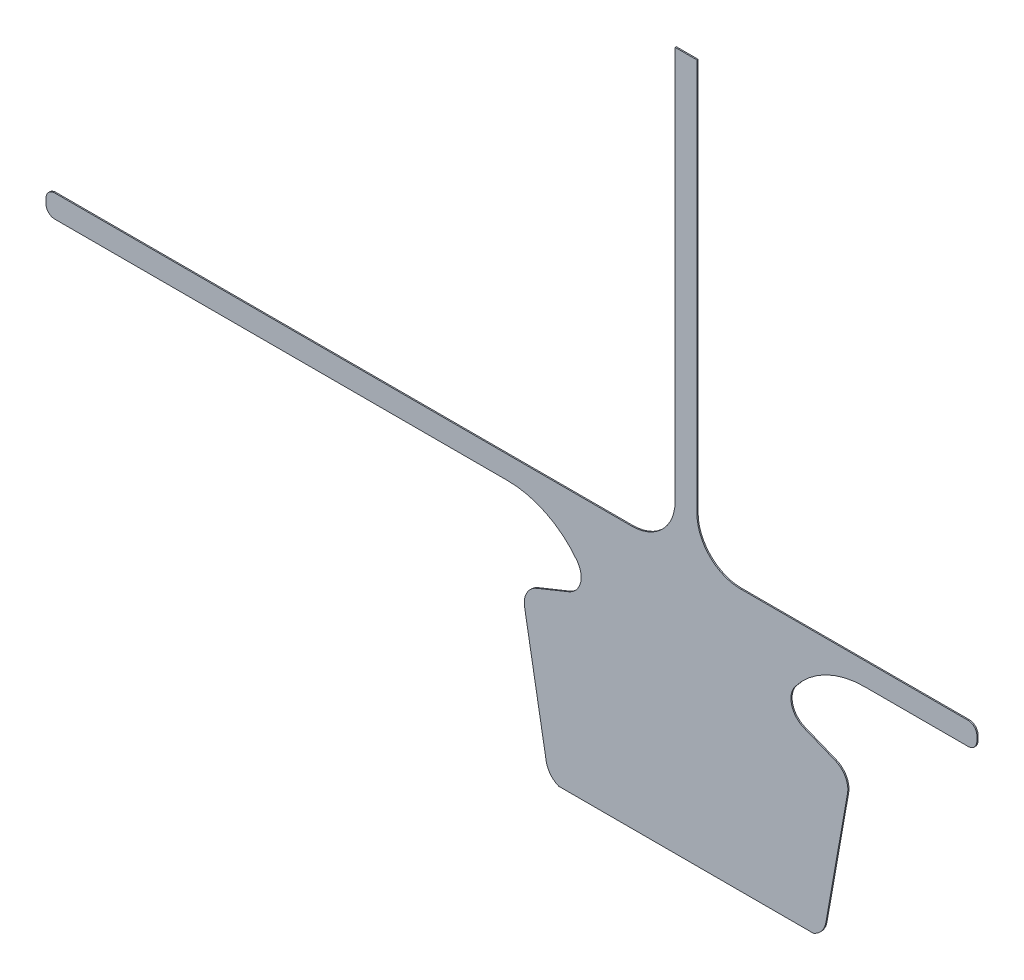
ISO-10303-21;
HEADER;
FILE_DESCRIPTION(('STEP AP214'),'2;1');
FILE_NAME('part.step','',(''),(''),'','','');
FILE_SCHEMA(('AUTOMOTIVE_DESIGN { 1 0 10303 214 1 1 1 1 }'));
ENDSEC;
DATA;
#1=APPLICATION_CONTEXT('core data for automotive mechanical design processes');
#2=APPLICATION_PROTOCOL_DEFINITION('international standard','automotive_design',2000,#1);
#3=PRODUCT_CONTEXT('',#1,'mechanical');
#4=PRODUCT('Part','Part','',(#3));
#5=PRODUCT_RELATED_PRODUCT_CATEGORY('part','',(#4));
#6=PRODUCT_DEFINITION_FORMATION('','',#4);
#7=PRODUCT_DEFINITION_CONTEXT('part definition',#1,'design');
#8=PRODUCT_DEFINITION('design','',#6,#7);
#9=PRODUCT_DEFINITION_SHAPE('','',#8);
#10=(LENGTH_UNIT() NAMED_UNIT(*) SI_UNIT(.MILLI.,.METRE.));
#11=(NAMED_UNIT(*) PLANE_ANGLE_UNIT() SI_UNIT($,.RADIAN.));
#12=(NAMED_UNIT(*) SI_UNIT($,.STERADIAN.) SOLID_ANGLE_UNIT());
#13=UNCERTAINTY_MEASURE_WITH_UNIT(LENGTH_MEASURE(1.E-05),#10,'distance_accuracy_value','');
#14=(GEOMETRIC_REPRESENTATION_CONTEXT(3) GLOBAL_UNCERTAINTY_ASSIGNED_CONTEXT((#13)) GLOBAL_UNIT_ASSIGNED_CONTEXT((#10,
#11,#12)) REPRESENTATION_CONTEXT('',''));
#15=CARTESIAN_POINT('',(0.,0.,0.));
#16=DIRECTION('',(0.,0.,1.));
#17=DIRECTION('',(1.,0.,0.));
#18=AXIS2_PLACEMENT_3D('',#15,#16,#17);
#19=CARTESIAN_POINT('',(-109.35102561515,167.803727772906,1.016));
#20=DIRECTION('',(0.,0.,-1.));
#21=DIRECTION('',(-1.,0.,0.));
#22=AXIS2_PLACEMENT_3D('',#19,#20,#21);
#23=CYLINDRICAL_SURFACE('',#22,17.7800000000008);
#24=CARTESIAN_POINT('',(-109.35102561515,167.803727772906,0.));
#25=DIRECTION('',(0.,0.,-1.));
#26=DIRECTION('',(1.,0.,0.));
#27=AXIS2_PLACEMENT_3D('',#24,#25,#26);
#28=CIRCLE('',#27,17.7800000000008);
#29=CARTESIAN_POINT('',(-95.1549494052422,178.508858329915,0.));
#30=VERTEX_POINT('',#29);
#31=CARTESIAN_POINT('',(-102.690520384216,151.318398838708,0.));
#32=VERTEX_POINT('',#31);
#33=EDGE_CURVE('E250',#30,#32,#28,.T.);
#34=ORIENTED_EDGE('',*,*,#33,.T.);
#35=DIRECTION('',(0.,0.,-1.));
#36=VECTOR('',#35,1.);
#37=CARTESIAN_POINT('',(-102.690520384216,151.318398838708,1.016));
#38=LINE('',#37,#36);
#39=CARTESIAN_POINT('',(-102.690520384216,151.318398838708,1.016));
#40=VERTEX_POINT('',#39);
#41=EDGE_CURVE('E11',#40,#32,#38,.T.);
#42=ORIENTED_EDGE('',*,*,#41,.F.);
#43=CARTESIAN_POINT('',(-109.35102561515,167.803727772906,1.016));
#44=DIRECTION('',(0.,0.,-1.));
#45=DIRECTION('',(1.,0.,0.));
#46=AXIS2_PLACEMENT_3D('',#43,#44,#45);
#47=CIRCLE('',#46,17.7800000000008);
#48=CARTESIAN_POINT('',(-95.1549494052422,178.508858329915,1.016));
#49=VERTEX_POINT('',#48);
#50=EDGE_CURVE('E304',#49,#40,#47,.T.);
#51=ORIENTED_EDGE('',*,*,#50,.F.);
#52=DIRECTION('',(0.,0.,-1.));
#53=VECTOR('',#52,1.);
#54=CARTESIAN_POINT('',(-95.1549494052422,178.508858329915,1.016));
#55=LINE('',#54,#53);
#56=EDGE_CURVE('E246',#49,#30,#55,.T.);
#57=ORIENTED_EDGE('',*,*,#56,.T.);
#58=EDGE_LOOP('',(#34,#42,#51,#57));
#59=FACE_BOUND('',#58,.T.);
#60=ADVANCED_FACE('F34',(#59),#23,.F.);
#61=CARTESIAN_POINT('',(-102.690520384216,151.318398838708,1.016));
#62=DIRECTION('',(0.374606593416,-0.927183854566752,0.));
#63=DIRECTION('',(0.927183854566752,0.374606593416,0.));
#64=AXIS2_PLACEMENT_3D('',#61,#62,#63);
#65=PLANE('',#64);
#66=DIRECTION('',(-0.927183854566752,-0.374606593416,0.));
#67=VECTOR('',#66,1.);
#68=CARTESIAN_POINT('',(-102.690520384216,151.318398838708,0.));
#69=LINE('',#68,#67);
#70=CARTESIAN_POINT('',(-130.138661402998,140.228630016695,0.));
#71=VERTEX_POINT('',#70);
#72=EDGE_CURVE('E253',#32,#71,#69,.T.);
#73=ORIENTED_EDGE('',*,*,#72,.T.);
#74=DIRECTION('',(0.,0.,-1.));
#75=VECTOR('',#74,1.);
#76=CARTESIAN_POINT('',(-130.138661402998,140.228630016695,1.016));
#77=LINE('',#76,#75);
#78=CARTESIAN_POINT('',(-130.138661402998,140.228630016695,1.016));
#79=VERTEX_POINT('',#78);
#80=EDGE_CURVE('E42',#79,#71,#77,.T.);
#81=ORIENTED_EDGE('',*,*,#80,.F.);
#82=DIRECTION('',(-0.927183854566752,-0.374606593416,0.));
#83=VECTOR('',#82,1.);
#84=CARTESIAN_POINT('',(-102.690520384216,151.318398838708,1.016));
#85=LINE('',#84,#83);
#86=EDGE_CURVE('E153',#40,#79,#85,.T.);
#87=ORIENTED_EDGE('',*,*,#86,.F.);
#88=ORIENTED_EDGE('',*,*,#41,.T.);
#89=EDGE_LOOP('',(#73,#81,#87,#88));
#90=FACE_BOUND('',#89,.T.);
#91=ADVANCED_FACE('F462',(#90),#65,.F.);
#92=CARTESIAN_POINT('',(-123.478156172063,123.743301082497,1.016));
#93=DIRECTION('',(0.,0.,-1.));
#94=DIRECTION('',(-1.,0.,0.));
#95=AXIS2_PLACEMENT_3D('',#92,#93,#94);
#96=CYLINDRICAL_SURFACE('',#95,17.7800000000006);
#97=CARTESIAN_POINT('',(-123.478156172063,123.743301082497,0.));
#98=DIRECTION('',(0.,0.,1.));
#99=DIRECTION('',(1.,0.,0.));
#100=AXIS2_PLACEMENT_3D('',#97,#98,#99);
#101=CIRCLE('',#100,17.7800000000006);
#102=CARTESIAN_POINT('',(-140.98803802062,120.655836483576,0.));
#103=VERTEX_POINT('',#102);
#104=EDGE_CURVE('E255',#71,#103,#101,.T.);
#105=ORIENTED_EDGE('',*,*,#104,.T.);
#106=DIRECTION('',(0.,0.,-1.));
#107=VECTOR('',#106,1.);
#108=CARTESIAN_POINT('',(-140.98803802062,120.655836483576,1.016));
#109=LINE('',#108,#107);
#110=CARTESIAN_POINT('',(-140.98803802062,120.655836483576,1.016));
#111=VERTEX_POINT('',#110);
#112=EDGE_CURVE('E371',#111,#103,#109,.T.);
#113=ORIENTED_EDGE('',*,*,#112,.F.);
#114=CARTESIAN_POINT('',(-123.478156172063,123.743301082497,1.016));
#115=DIRECTION('',(0.,0.,1.));
#116=DIRECTION('',(1.,0.,0.));
#117=AXIS2_PLACEMENT_3D('',#114,#115,#116);
#118=CIRCLE('',#117,17.7800000000006);
#119=EDGE_CURVE('E379',#79,#111,#118,.T.);
#120=ORIENTED_EDGE('',*,*,#119,.F.);
#121=ORIENTED_EDGE('',*,*,#80,.T.);
#122=EDGE_LOOP('',(#105,#113,#120,#121));
#123=FACE_BOUND('',#122,.T.);
#124=ADVANCED_FACE('F377',(#123),#96,.T.);
#125=CARTESIAN_POINT('',(-140.98803802062,120.655836483576,1.016));
#126=DIRECTION('',(0.984807753012179,0.173648177667092,0.));
#127=DIRECTION('',(-0.173648177667092,0.984807753012179,0.));
#128=AXIS2_PLACEMENT_3D('',#125,#126,#127);
#129=PLANE('',#128);
#130=DIRECTION('',(0.173648177667092,-0.984807753012179,0.));
#131=VECTOR('',#130,1.);
#132=CARTESIAN_POINT('',(-140.98803802062,120.655836483576,0.));
#133=LINE('',#132,#131);
#134=CARTESIAN_POINT('',(-122.08304118575,13.4402716341482,0.));
#135=VERTEX_POINT('',#134);
#136=EDGE_CURVE('E257',#103,#135,#133,.T.);
#137=ORIENTED_EDGE('',*,*,#136,.T.);
#138=DIRECTION('',(0.,0.,-1.));
#139=VECTOR('',#138,1.);
#140=CARTESIAN_POINT('',(-122.08304118575,13.4402716341482,1.016));
#141=LINE('',#140,#139);
#142=CARTESIAN_POINT('',(-122.08304118575,13.4402716341482,1.016));
#143=VERTEX_POINT('',#142);
#144=EDGE_CURVE('E368',#143,#135,#141,.T.);
#145=ORIENTED_EDGE('',*,*,#144,.F.);
#146=DIRECTION('',(0.173648177667092,-0.984807753012179,0.));
#147=VECTOR('',#146,1.);
#148=CARTESIAN_POINT('',(-140.98803802062,120.655836483576,1.016));
#149=LINE('',#148,#147);
#150=EDGE_CURVE('E397',#111,#143,#149,.T.);
#151=ORIENTED_EDGE('',*,*,#150,.F.);
#152=ORIENTED_EDGE('',*,*,#112,.T.);
#153=EDGE_LOOP('',(#137,#145,#151,#152));
#154=FACE_BOUND('',#153,.T.);
#155=ADVANCED_FACE('F388',(#154),#129,.F.);
#156=CARTESIAN_POINT('',(-104.573159337193,16.5277362330692,1.016));
#157=DIRECTION('',(0.,0.,-1.));
#158=DIRECTION('',(-1.,0.,0.));
#159=AXIS2_PLACEMENT_3D('',#156,#157,#158);
#160=CYLINDRICAL_SURFACE('',#159,17.780000000004);
#161=CARTESIAN_POINT('',(-104.573159337193,16.5277362330692,0.));
#162=DIRECTION('',(0.,0.,1.));
#163=DIRECTION('',(1.,0.,0.));
#164=AXIS2_PLACEMENT_3D('',#161,#162,#163);
#165=CIRCLE('',#164,17.780000000004);
#166=CARTESIAN_POINT('',(-111.127725303842,2.7595981055839E-11,0.));
#167=VERTEX_POINT('',#166);
#168=EDGE_CURVE('E259',#135,#167,#165,.T.);
#169=ORIENTED_EDGE('',*,*,#168,.T.);
#170=DIRECTION('',(0.,0.,-1.));
#171=VECTOR('',#170,1.);
#172=CARTESIAN_POINT('',(-111.127725303842,2.7595981055839E-11,1.016));
#173=LINE('',#172,#171);
#174=CARTESIAN_POINT('',(-111.127725303842,2.7595981055839E-11,1.016));
#175=VERTEX_POINT('',#174);
#176=EDGE_CURVE('E365',#175,#167,#173,.T.);
#177=ORIENTED_EDGE('',*,*,#176,.F.);
#178=CARTESIAN_POINT('',(-104.573159337193,16.5277362330692,1.016));
#179=DIRECTION('',(0.,0.,1.));
#180=DIRECTION('',(1.,0.,0.));
#181=AXIS2_PLACEMENT_3D('',#178,#179,#180);
#182=CIRCLE('',#181,17.780000000004);
#183=EDGE_CURVE('E394',#143,#175,#182,.T.);
#184=ORIENTED_EDGE('',*,*,#183,.F.);
#185=ORIENTED_EDGE('',*,*,#144,.T.);
#186=EDGE_LOOP('',(#169,#177,#184,#185));
#187=FACE_BOUND('',#186,.T.);
#188=ADVANCED_FACE('F392',(#187),#160,.T.);
#189=CARTESIAN_POINT('',(-111.127725303843,2.43803408643757E-11,1.016));
#190=DIRECTION('',(0.,1.,0.));
#191=DIRECTION('',(-1.,0.,0.));
#192=AXIS2_PLACEMENT_3D('',#189,#190,#191);
#193=PLANE('',#192);
#194=DIRECTION('',(1.,0.,0.));
#195=VECTOR('',#194,1.);
#196=CARTESIAN_POINT('',(-111.127725303843,2.43803408643757E-11,0.));
#197=LINE('',#196,#195);
#198=CARTESIAN_POINT('',(111.127725303835,2.44075593069937E-11,0.));
#199=VERTEX_POINT('',#198);
#200=EDGE_CURVE('E261',#167,#199,#197,.T.);
#201=ORIENTED_EDGE('',*,*,#200,.T.);
#202=DIRECTION('',(0.,0.,-1.));
#203=VECTOR('',#202,1.);
#204=CARTESIAN_POINT('',(111.127725303835,2.44075593069937E-11,1.016));
#205=LINE('',#204,#203);
#206=CARTESIAN_POINT('',(111.127725303835,2.44075593069937E-11,1.016));
#207=VERTEX_POINT('',#206);
#208=EDGE_CURVE('E362',#207,#199,#205,.T.);
#209=ORIENTED_EDGE('',*,*,#208,.F.);
#210=DIRECTION('',(1.,0.,0.));
#211=VECTOR('',#210,1.);
#212=CARTESIAN_POINT('',(-111.127725303843,2.43803408643757E-11,1.016));
#213=LINE('',#212,#211);
#214=EDGE_CURVE('E396',#175,#207,#213,.T.);
#215=ORIENTED_EDGE('',*,*,#214,.F.);
#216=ORIENTED_EDGE('',*,*,#176,.T.);
#217=EDGE_LOOP('',(#201,#209,#215,#216));
#218=FACE_BOUND('',#217,.T.);
#219=ADVANCED_FACE('F475',(#218),#193,.F.);
#220=CARTESIAN_POINT('',(104.573159337193,16.527736233065,1.016));
#221=DIRECTION('',(0.,0.,-1.));
#222=DIRECTION('',(-1.,0.,0.));
#223=AXIS2_PLACEMENT_3D('',#220,#221,#222);
#224=CYLINDRICAL_SURFACE('',#223,17.7800000000006);
#225=CARTESIAN_POINT('',(104.573159337193,16.527736233065,0.));
#226=DIRECTION('',(0.,0.,1.));
#227=DIRECTION('',(1.,0.,0.));
#228=AXIS2_PLACEMENT_3D('',#225,#226,#227);
#229=CIRCLE('',#228,17.7800000000006);
#230=CARTESIAN_POINT('',(122.08304118575,13.440271634144,0.));
#231=VERTEX_POINT('',#230);
#232=EDGE_CURVE('E263',#199,#231,#229,.T.);
#233=ORIENTED_EDGE('',*,*,#232,.T.);
#234=DIRECTION('',(0.,0.,-1.));
#235=VECTOR('',#234,1.);
#236=CARTESIAN_POINT('',(122.08304118575,13.440271634144,1.016));
#237=LINE('',#236,#235);
#238=CARTESIAN_POINT('',(122.08304118575,13.440271634144,1.016));
#239=VERTEX_POINT('',#238);
#240=EDGE_CURVE('E359',#239,#231,#237,.T.);
#241=ORIENTED_EDGE('',*,*,#240,.F.);
#242=CARTESIAN_POINT('',(104.573159337193,16.527736233065,1.016));
#243=DIRECTION('',(0.,0.,1.));
#244=DIRECTION('',(1.,0.,0.));
#245=AXIS2_PLACEMENT_3D('',#242,#243,#244);
#246=CIRCLE('',#245,17.7800000000006);
#247=EDGE_CURVE('E399',#207,#239,#246,.T.);
#248=ORIENTED_EDGE('',*,*,#247,.F.);
#249=ORIENTED_EDGE('',*,*,#208,.T.);
#250=EDGE_LOOP('',(#233,#241,#248,#249));
#251=FACE_BOUND('',#250,.T.);
#252=ADVANCED_FACE('F478',(#251),#224,.T.);
#253=CARTESIAN_POINT('',(122.08304118575,13.440271634144,1.016));
#254=DIRECTION('',(-0.984807753012182,0.173648177667078,0.));
#255=DIRECTION('',(-0.173648177667078,-0.984807753012182,0.));
#256=AXIS2_PLACEMENT_3D('',#253,#254,#255);
#257=PLANE('',#256);
#258=DIRECTION('',(0.173648177667078,0.984807753012182,0.));
#259=VECTOR('',#258,1.);
#260=CARTESIAN_POINT('',(122.08304118575,13.440271634144,0.));
#261=LINE('',#260,#259);
#262=CARTESIAN_POINT('',(140.98803802062,120.65583648358,0.));
#263=VERTEX_POINT('',#262);
#264=EDGE_CURVE('E265',#231,#263,#261,.T.);
#265=ORIENTED_EDGE('',*,*,#264,.T.);
#266=DIRECTION('',(0.,0.,-1.));
#267=VECTOR('',#266,1.);
#268=CARTESIAN_POINT('',(140.98803802062,120.65583648358,1.016));
#269=LINE('',#268,#267);
#270=CARTESIAN_POINT('',(140.98803802062,120.65583648358,1.016));
#271=VERTEX_POINT('',#270);
#272=EDGE_CURVE('E356',#271,#263,#269,.T.);
#273=ORIENTED_EDGE('',*,*,#272,.F.);
#274=DIRECTION('',(0.173648177667078,0.984807753012182,0.));
#275=VECTOR('',#274,1.);
#276=CARTESIAN_POINT('',(122.08304118575,13.440271634144,1.016));
#277=LINE('',#276,#275);
#278=EDGE_CURVE('E405',#239,#271,#277,.T.);
#279=ORIENTED_EDGE('',*,*,#278,.F.);
#280=ORIENTED_EDGE('',*,*,#240,.T.);
#281=EDGE_LOOP('',(#265,#273,#279,#280));
#282=FACE_BOUND('',#281,.T.);
#283=ADVANCED_FACE('F482',(#282),#257,.F.);
#284=CARTESIAN_POINT('',(123.478156172063,123.743301082501,1.016));
#285=DIRECTION('',(0.,0.,-1.));
#286=DIRECTION('',(-1.,0.,0.));
#287=AXIS2_PLACEMENT_3D('',#284,#285,#286);
#288=CYLINDRICAL_SURFACE('',#287,17.7800000000006);
#289=CARTESIAN_POINT('',(123.478156172063,123.743301082501,0.));
#290=DIRECTION('',(0.,0.,1.));
#291=DIRECTION('',(1.,0.,0.));
#292=AXIS2_PLACEMENT_3D('',#289,#290,#291);
#293=CIRCLE('',#292,17.7800000000006);
#294=CARTESIAN_POINT('',(130.138661402997,140.228630016699,0.));
#295=VERTEX_POINT('',#294);
#296=EDGE_CURVE('E267',#263,#295,#293,.T.);
#297=ORIENTED_EDGE('',*,*,#296,.T.);
#298=DIRECTION('',(0.,0.,-1.));
#299=VECTOR('',#298,1.);
#300=CARTESIAN_POINT('',(130.138661402997,140.228630016699,1.016));
#301=LINE('',#300,#299);
#302=CARTESIAN_POINT('',(130.138661402997,140.228630016699,1.016));
#303=VERTEX_POINT('',#302);
#304=EDGE_CURVE('E353',#303,#295,#301,.T.);
#305=ORIENTED_EDGE('',*,*,#304,.F.);
#306=CARTESIAN_POINT('',(123.478156172063,123.743301082501,1.016));
#307=DIRECTION('',(0.,0.,1.));
#308=DIRECTION('',(1.,0.,0.));
#309=AXIS2_PLACEMENT_3D('',#306,#307,#308);
#310=CIRCLE('',#309,17.7800000000006);
#311=EDGE_CURVE('E407',#271,#303,#310,.T.);
#312=ORIENTED_EDGE('',*,*,#311,.F.);
#313=ORIENTED_EDGE('',*,*,#272,.T.);
#314=EDGE_LOOP('',(#297,#305,#312,#313));
#315=FACE_BOUND('',#314,.T.);
#316=ADVANCED_FACE('F486',(#315),#288,.T.);
#317=CARTESIAN_POINT('',(130.138661402997,140.228630016699,1.016));
#318=DIRECTION('',(-0.374606593415798,-0.927183854566834,0.));
#319=DIRECTION('',(0.927183854566834,-0.374606593415798,0.));
#320=AXIS2_PLACEMENT_3D('',#317,#318,#319);
#321=PLANE('',#320);
#322=DIRECTION('',(-0.927183854566834,0.374606593415798,0.));
#323=VECTOR('',#322,1.);
#324=CARTESIAN_POINT('',(130.138661402997,140.228630016699,0.));
#325=LINE('',#324,#323);
#326=CARTESIAN_POINT('',(102.690520384208,151.318398838708,0.));
#327=VERTEX_POINT('',#326);
#328=EDGE_CURVE('E269',#295,#327,#325,.T.);
#329=ORIENTED_EDGE('',*,*,#328,.T.);
#330=DIRECTION('',(0.,0.,-1.));
#331=VECTOR('',#330,1.);
#332=CARTESIAN_POINT('',(102.690520384208,151.318398838708,1.016));
#333=LINE('',#332,#331);
#334=CARTESIAN_POINT('',(102.690520384208,151.318398838708,1.016));
#335=VERTEX_POINT('',#334);
#336=EDGE_CURVE('E350',#335,#327,#333,.T.);
#337=ORIENTED_EDGE('',*,*,#336,.F.);
#338=DIRECTION('',(-0.927183854566834,0.374606593415798,0.));
#339=VECTOR('',#338,1.);
#340=CARTESIAN_POINT('',(130.138661402997,140.228630016699,1.016));
#341=LINE('',#340,#339);
#342=EDGE_CURVE('E409',#303,#335,#341,.T.);
#343=ORIENTED_EDGE('',*,*,#342,.F.);
#344=ORIENTED_EDGE('',*,*,#304,.T.);
#345=EDGE_LOOP('',(#329,#337,#343,#344));
#346=FACE_BOUND('',#345,.T.);
#347=ADVANCED_FACE('F490',(#346),#321,.F.);
#348=CARTESIAN_POINT('',(109.351025615142,167.803727772906,1.016));
#349=DIRECTION('',(0.,0.,-1.));
#350=DIRECTION('',(-1.,0.,0.));
#351=AXIS2_PLACEMENT_3D('',#348,#349,#350);
#352=CYLINDRICAL_SURFACE('',#351,17.7800000000001);
#353=CARTESIAN_POINT('',(109.351025615142,167.803727772906,0.));
#354=DIRECTION('',(0.,0.,-1.));
#355=DIRECTION('',(1.,0.,0.));
#356=AXIS2_PLACEMENT_3D('',#353,#354,#355);
#357=CIRCLE('',#356,17.7800000000001);
#358=CARTESIAN_POINT('',(95.1549494052372,178.508858329913,0.));
#359=VERTEX_POINT('',#358);
#360=EDGE_CURVE('E271',#327,#359,#357,.T.);
#361=ORIENTED_EDGE('',*,*,#360,.T.);
#362=DIRECTION('',(0.,0.,-1.));
#363=VECTOR('',#362,1.);
#364=CARTESIAN_POINT('',(95.1549494052372,178.508858329913,1.016));
#365=LINE('',#364,#363);
#366=CARTESIAN_POINT('',(95.1549494052372,178.508858329913,1.016));
#367=VERTEX_POINT('',#366);
#368=EDGE_CURVE('E347',#367,#359,#365,.T.);
#369=ORIENTED_EDGE('',*,*,#368,.F.);
#370=CARTESIAN_POINT('',(109.351025615142,167.803727772906,1.016));
#371=DIRECTION('',(0.,0.,-1.));
#372=DIRECTION('',(1.,0.,0.));
#373=AXIS2_PLACEMENT_3D('',#370,#371,#372);
#374=CIRCLE('',#373,17.7800000000001);
#375=EDGE_CURVE('E411',#335,#367,#374,.T.);
#376=ORIENTED_EDGE('',*,*,#375,.F.);
#377=ORIENTED_EDGE('',*,*,#336,.T.);
#378=EDGE_LOOP('',(#361,#369,#376,#377));
#379=FACE_BOUND('',#378,.T.);
#380=ADVANCED_FACE('F494',(#379),#352,.F.);
#381=CARTESIAN_POINT('',(155.995276019115,132.629727371311,1.016));
#382=DIRECTION('',(0.,0.,-1.));
#383=DIRECTION('',(-1.,0.,0.));
#384=AXIS2_PLACEMENT_3D('',#381,#382,#383);
#385=CYLINDRICAL_SURFACE('',#384,76.1999999999997);
#386=CARTESIAN_POINT('',(155.995276019115,132.629727371311,0.));
#387=DIRECTION('',(0.,0.,-1.));
#388=DIRECTION('',(1.,0.,0.));
#389=AXIS2_PLACEMENT_3D('',#386,#387,#388);
#390=CIRCLE('',#389,76.1999999999997);
#391=CARTESIAN_POINT('',(155.995276019115,208.82972737131,0.));
#392=VERTEX_POINT('',#391);
#393=EDGE_CURVE('E273',#359,#392,#390,.T.);
#394=ORIENTED_EDGE('',*,*,#393,.T.);
#395=DIRECTION('',(0.,0.,-1.));
#396=VECTOR('',#395,1.);
#397=CARTESIAN_POINT('',(155.995276019115,208.82972737131,1.016));
#398=LINE('',#397,#396);
#399=CARTESIAN_POINT('',(155.995276019115,208.82972737131,1.016));
#400=VERTEX_POINT('',#399);
#401=EDGE_CURVE('E344',#400,#392,#398,.T.);
#402=ORIENTED_EDGE('',*,*,#401,.F.);
#403=CARTESIAN_POINT('',(155.995276019115,132.629727371311,1.016));
#404=DIRECTION('',(0.,0.,-1.));
#405=DIRECTION('',(1.,0.,0.));
#406=AXIS2_PLACEMENT_3D('',#403,#404,#405);
#407=CIRCLE('',#406,76.1999999999997);
#408=EDGE_CURVE('E413',#367,#400,#407,.T.);
#409=ORIENTED_EDGE('',*,*,#408,.F.);
#410=ORIENTED_EDGE('',*,*,#368,.T.);
#411=EDGE_LOOP('',(#394,#402,#409,#410));
#412=FACE_BOUND('',#411,.T.);
#413=ADVANCED_FACE('F498',(#412),#385,.F.);
#414=CARTESIAN_POINT('',(155.995276019115,208.82972737131,1.016));
#415=DIRECTION('',(0.,1.,0.));
#416=DIRECTION('',(-1.,0.,0.));
#417=AXIS2_PLACEMENT_3D('',#414,#415,#416);
#418=PLANE('',#417);
#419=DIRECTION('',(1.,0.,0.));
#420=VECTOR('',#419,1.);
#421=CARTESIAN_POINT('',(155.995276019115,208.82972737131,0.));
#422=LINE('',#421,#420);
#423=CARTESIAN_POINT('',(246.294572316109,208.829727371311,0.));
#424=VERTEX_POINT('',#423);
#425=EDGE_CURVE('E275',#392,#424,#422,.T.);
#426=ORIENTED_EDGE('',*,*,#425,.T.);
#427=DIRECTION('',(0.,0.,-1.));
#428=VECTOR('',#427,1.);
#429=CARTESIAN_POINT('',(246.294572316109,208.829727371311,1.016));
#430=LINE('',#429,#428);
#431=CARTESIAN_POINT('',(246.294572316109,208.829727371311,1.016));
#432=VERTEX_POINT('',#431);
#433=EDGE_CURVE('E341',#432,#424,#430,.T.);
#434=ORIENTED_EDGE('',*,*,#433,.F.);
#435=DIRECTION('',(1.,0.,0.));
#436=VECTOR('',#435,1.);
#437=CARTESIAN_POINT('',(155.995276019115,208.82972737131,1.016));
#438=LINE('',#437,#436);
#439=EDGE_CURVE('E415',#400,#432,#438,.T.);
#440=ORIENTED_EDGE('',*,*,#439,.F.);
#441=ORIENTED_EDGE('',*,*,#401,.T.);
#442=EDGE_LOOP('',(#426,#434,#440,#441));
#443=FACE_BOUND('',#442,.T.);
#444=ADVANCED_FACE('F502',(#443),#418,.F.);
#445=CARTESIAN_POINT('',(246.294572316109,216.449727371311,1.016));
#446=DIRECTION('',(0.,0.,-1.));
#447=DIRECTION('',(-1.,0.,0.));
#448=AXIS2_PLACEMENT_3D('',#445,#446,#447);
#449=CYLINDRICAL_SURFACE('',#448,7.61999999999996);
#450=CARTESIAN_POINT('',(246.294572316109,216.449727371311,0.));
#451=DIRECTION('',(0.,0.,1.));
#452=DIRECTION('',(1.,0.,0.));
#453=AXIS2_PLACEMENT_3D('',#450,#451,#452);
#454=CIRCLE('',#453,7.61999999999996);
#455=CARTESIAN_POINT('',(253.914572316109,216.449727371311,0.));
#456=VERTEX_POINT('',#455);
#457=EDGE_CURVE('E277',#424,#456,#454,.T.);
#458=ORIENTED_EDGE('',*,*,#457,.T.);
#459=DIRECTION('',(0.,0.,-1.));
#460=VECTOR('',#459,1.);
#461=CARTESIAN_POINT('',(253.914572316109,216.449727371311,1.016));
#462=LINE('',#461,#460);
#463=CARTESIAN_POINT('',(253.914572316109,216.449727371311,1.016));
#464=VERTEX_POINT('',#463);
#465=EDGE_CURVE('E338',#464,#456,#462,.T.);
#466=ORIENTED_EDGE('',*,*,#465,.F.);
#467=CARTESIAN_POINT('',(246.294572316109,216.449727371311,1.016));
#468=DIRECTION('',(0.,0.,1.));
#469=DIRECTION('',(1.,0.,0.));
#470=AXIS2_PLACEMENT_3D('',#467,#468,#469);
#471=CIRCLE('',#470,7.61999999999996);
#472=EDGE_CURVE('E417',#432,#464,#471,.T.);
#473=ORIENTED_EDGE('',*,*,#472,.F.);
#474=ORIENTED_EDGE('',*,*,#433,.T.);
#475=EDGE_LOOP('',(#458,#466,#473,#474));
#476=FACE_BOUND('',#475,.T.);
#477=ADVANCED_FACE('F506',(#476),#449,.T.);
#478=CARTESIAN_POINT('',(253.914572316109,216.449727371311,1.016));
#479=DIRECTION('',(-1.,9.43510246539028E-13,0.));
#480=DIRECTION('',(-9.43510246539028E-13,-1.,0.));
#481=AXIS2_PLACEMENT_3D('',#478,#479,#480);
#482=PLANE('',#481);
#483=DIRECTION('',(9.43510246539028E-13,1.,0.));
#484=VECTOR('',#483,1.);
#485=CARTESIAN_POINT('',(253.914572316109,216.449727371311,0.));
#486=LINE('',#485,#484);
#487=CARTESIAN_POINT('',(253.914572316114,220.980000000024,0.));
#488=VERTEX_POINT('',#487);
#489=EDGE_CURVE('E279',#456,#488,#486,.T.);
#490=ORIENTED_EDGE('',*,*,#489,.T.);
#491=DIRECTION('',(0.,0.,-1.));
#492=VECTOR('',#491,1.);
#493=CARTESIAN_POINT('',(253.914572316114,220.980000000024,1.016));
#494=LINE('',#493,#492);
#495=CARTESIAN_POINT('',(253.914572316114,220.980000000024,1.016));
#496=VERTEX_POINT('',#495);
#497=EDGE_CURVE('E335',#496,#488,#494,.T.);
#498=ORIENTED_EDGE('',*,*,#497,.F.);
#499=DIRECTION('',(9.43510246539028E-13,1.,0.));
#500=VECTOR('',#499,1.);
#501=CARTESIAN_POINT('',(253.914572316109,216.449727371311,1.016));
#502=LINE('',#501,#500);
#503=EDGE_CURVE('E419',#464,#496,#502,.T.);
#504=ORIENTED_EDGE('',*,*,#503,.F.);
#505=ORIENTED_EDGE('',*,*,#465,.T.);
#506=EDGE_LOOP('',(#490,#498,#504,#505));
#507=FACE_BOUND('',#506,.T.);
#508=ADVANCED_FACE('F510',(#507),#482,.F.);
#509=CARTESIAN_POINT('',(246.294572316114,220.980000000024,1.016));
#510=DIRECTION('',(0.,0.,-1.));
#511=DIRECTION('',(-1.,0.,0.));
#512=AXIS2_PLACEMENT_3D('',#509,#510,#511);
#513=CYLINDRICAL_SURFACE('',#512,7.61999999999997);
#514=CARTESIAN_POINT('',(246.294572316114,220.980000000024,0.));
#515=DIRECTION('',(0.,0.,1.));
#516=DIRECTION('',(1.,0.,0.));
#517=AXIS2_PLACEMENT_3D('',#514,#515,#516);
#518=CIRCLE('',#517,7.61999999999997);
#519=CARTESIAN_POINT('',(246.294572316114,228.600000000024,0.));
#520=VERTEX_POINT('',#519);
#521=EDGE_CURVE('E281',#488,#520,#518,.T.);
#522=ORIENTED_EDGE('',*,*,#521,.T.);
#523=DIRECTION('',(0.,0.,-1.));
#524=VECTOR('',#523,1.);
#525=CARTESIAN_POINT('',(246.294572316114,228.600000000024,1.016));
#526=LINE('',#525,#524);
#527=CARTESIAN_POINT('',(246.294572316114,228.600000000024,1.016));
#528=VERTEX_POINT('',#527);
#529=EDGE_CURVE('E332',#528,#520,#526,.T.);
#530=ORIENTED_EDGE('',*,*,#529,.F.);
#531=CARTESIAN_POINT('',(246.294572316114,220.980000000024,1.016));
#532=DIRECTION('',(0.,0.,1.));
#533=DIRECTION('',(1.,0.,0.));
#534=AXIS2_PLACEMENT_3D('',#531,#532,#533);
#535=CIRCLE('',#534,7.61999999999997);
#536=EDGE_CURVE('E421',#496,#528,#535,.T.);
#537=ORIENTED_EDGE('',*,*,#536,.F.);
#538=ORIENTED_EDGE('',*,*,#497,.T.);
#539=EDGE_LOOP('',(#522,#530,#537,#538));
#540=FACE_BOUND('',#539,.T.);
#541=ADVANCED_FACE('F514',(#540),#513,.T.);
#542=CARTESIAN_POINT('',(246.294572316114,228.600000000024,1.016));
#543=DIRECTION('',(0.,-1.,0.));
#544=DIRECTION('',(1.,0.,0.));
#545=AXIS2_PLACEMENT_3D('',#542,#543,#544);
#546=PLANE('',#545);
#547=DIRECTION('',(-1.,0.,0.));
#548=VECTOR('',#547,1.);
#549=CARTESIAN_POINT('',(246.294572316114,228.600000000024,0.));
#550=LINE('',#549,#548);
#551=CARTESIAN_POINT('',(47.4420050257153,228.600000000024,0.));
#552=VERTEX_POINT('',#551);
#553=EDGE_CURVE('E283',#520,#552,#550,.T.);
#554=ORIENTED_EDGE('',*,*,#553,.T.);
#555=DIRECTION('',(0.,0.,-1.));
#556=VECTOR('',#555,1.);
#557=CARTESIAN_POINT('',(47.4420050257153,228.600000000024,1.016));
#558=LINE('',#557,#556);
#559=CARTESIAN_POINT('',(47.4420050257153,228.600000000024,1.016));
#560=VERTEX_POINT('',#559);
#561=EDGE_CURVE('E329',#560,#552,#558,.T.);
#562=ORIENTED_EDGE('',*,*,#561,.F.);
#563=DIRECTION('',(-1.,0.,0.));
#564=VECTOR('',#563,1.);
#565=CARTESIAN_POINT('',(246.294572316114,228.600000000024,1.016));
#566=LINE('',#565,#564);
#567=EDGE_CURVE('E423',#528,#560,#566,.T.);
#568=ORIENTED_EDGE('',*,*,#567,.F.);
#569=ORIENTED_EDGE('',*,*,#529,.T.);
#570=EDGE_LOOP('',(#554,#562,#568,#569));
#571=FACE_BOUND('',#570,.T.);
#572=ADVANCED_FACE('F518',(#571),#546,.F.);
#573=CARTESIAN_POINT('',(47.4420050257153,266.51700502574,1.016));
#574=DIRECTION('',(0.,0.,-1.));
#575=DIRECTION('',(-1.,0.,0.));
#576=AXIS2_PLACEMENT_3D('',#573,#574,#575);
#577=CYLINDRICAL_SURFACE('',#576,37.9170050257152);
#578=CARTESIAN_POINT('',(47.4420050257153,266.51700502574,0.));
#579=DIRECTION('',(0.,0.,-1.));
#580=DIRECTION('',(1.,0.,0.));
#581=AXIS2_PLACEMENT_3D('',#578,#579,#580);
#582=CIRCLE('',#581,37.9170050257152);
#583=CARTESIAN_POINT('',(9.52500000000005,266.51700502574,0.));
#584=VERTEX_POINT('',#583);
#585=EDGE_CURVE('E285',#552,#584,#582,.T.);
#586=ORIENTED_EDGE('',*,*,#585,.T.);
#587=DIRECTION('',(0.,0.,-1.));
#588=VECTOR('',#587,1.);
#589=CARTESIAN_POINT('',(9.52500000000005,266.51700502574,1.016));
#590=LINE('',#589,#588);
#591=CARTESIAN_POINT('',(9.52500000000005,266.51700502574,1.016));
#592=VERTEX_POINT('',#591);
#593=EDGE_CURVE('E326',#592,#584,#590,.T.);
#594=ORIENTED_EDGE('',*,*,#593,.F.);
#595=CARTESIAN_POINT('',(47.4420050257153,266.51700502574,1.016));
#596=DIRECTION('',(0.,0.,-1.));
#597=DIRECTION('',(1.,0.,0.));
#598=AXIS2_PLACEMENT_3D('',#595,#596,#597);
#599=CIRCLE('',#598,37.9170050257152);
#600=EDGE_CURVE('E425',#560,#592,#599,.T.);
#601=ORIENTED_EDGE('',*,*,#600,.F.);
#602=ORIENTED_EDGE('',*,*,#561,.T.);
#603=EDGE_LOOP('',(#586,#594,#601,#602));
#604=FACE_BOUND('',#603,.T.);
#605=ADVANCED_FACE('F522',(#604),#577,.F.);
#606=CARTESIAN_POINT('',(9.52500000000004,266.51700502574,1.016));
#607=DIRECTION('',(-1.,0.,0.));
#608=DIRECTION('',(0.,-1.,0.));
#609=AXIS2_PLACEMENT_3D('',#606,#607,#608);
#610=PLANE('',#609);
#611=DIRECTION('',(0.,1.,0.));
#612=VECTOR('',#611,1.);
#613=CARTESIAN_POINT('',(9.52500000000004,266.51700502574,0.));
#614=LINE('',#613,#612);
#615=CARTESIAN_POINT('',(9.52499999999579,609.6,0.));
#616=VERTEX_POINT('',#615);
#617=EDGE_CURVE('E287',#584,#616,#614,.T.);
#618=ORIENTED_EDGE('',*,*,#617,.T.);
#619=DIRECTION('',(0.,0.,-1.));
#620=VECTOR('',#619,1.);
#621=CARTESIAN_POINT('',(9.52499999999579,609.6,1.016));
#622=LINE('',#621,#620);
#623=CARTESIAN_POINT('',(9.52499999999579,609.6,1.016));
#624=VERTEX_POINT('',#623);
#625=EDGE_CURVE('E323',#624,#616,#622,.T.);
#626=ORIENTED_EDGE('',*,*,#625,.F.);
#627=DIRECTION('',(0.,1.,0.));
#628=VECTOR('',#627,1.);
#629=CARTESIAN_POINT('',(9.52500000000004,266.51700502574,1.016));
#630=LINE('',#629,#628);
#631=EDGE_CURVE('E427',#592,#624,#630,.T.);
#632=ORIENTED_EDGE('',*,*,#631,.F.);
#633=ORIENTED_EDGE('',*,*,#593,.T.);
#634=EDGE_LOOP('',(#618,#626,#632,#633));
#635=FACE_BOUND('',#634,.T.);
#636=ADVANCED_FACE('F526',(#635),#610,.F.);
#637=CARTESIAN_POINT('',(9.52499999999579,609.6,1.016));
#638=DIRECTION('',(0.,-1.,0.));
#639=DIRECTION('',(0.,0.,-1.));
#640=AXIS2_PLACEMENT_3D('',#637,#638,#639);
#641=PLANE('',#640);
#642=DIRECTION('',(-1.,0.,0.));
#643=VECTOR('',#642,1.);
#644=CARTESIAN_POINT('',(9.52499999999579,609.6,0.));
#645=LINE('',#644,#643);
#646=CARTESIAN_POINT('',(-9.52500000000422,609.6,0.));
#647=VERTEX_POINT('',#646);
#648=EDGE_CURVE('E289',#616,#647,#645,.T.);
#649=ORIENTED_EDGE('',*,*,#648,.T.);
#650=DIRECTION('',(0.,0.,-1.));
#651=VECTOR('',#650,1.);
#652=CARTESIAN_POINT('',(-9.52500000000422,609.6,1.016));
#653=LINE('',#652,#651);
#654=CARTESIAN_POINT('',(-9.52500000000422,609.6,1.016));
#655=VERTEX_POINT('',#654);
#656=EDGE_CURVE('E320',#655,#647,#653,.T.);
#657=ORIENTED_EDGE('',*,*,#656,.F.);
#658=DIRECTION('',(-1.,0.,0.));
#659=VECTOR('',#658,1.);
#660=CARTESIAN_POINT('',(9.52499999999579,609.6,1.016));
#661=LINE('',#660,#659);
#662=EDGE_CURVE('E429',#624,#655,#661,.T.);
#663=ORIENTED_EDGE('',*,*,#662,.F.);
#664=ORIENTED_EDGE('',*,*,#625,.T.);
#665=EDGE_LOOP('',(#649,#657,#663,#664));
#666=FACE_BOUND('',#665,.T.);
#667=ADVANCED_FACE('F530',(#666),#641,.F.);
#668=CARTESIAN_POINT('',(-9.52500000000422,609.6,1.016));
#669=DIRECTION('',(1.,0.,0.));
#670=DIRECTION('',(0.,1.,0.));
#671=AXIS2_PLACEMENT_3D('',#668,#669,#670);
#672=PLANE('',#671);
#673=DIRECTION('',(0.,-1.,0.));
#674=VECTOR('',#673,1.);
#675=CARTESIAN_POINT('',(-9.52500000000422,609.6,0.));
#676=LINE('',#675,#674);
#677=CARTESIAN_POINT('',(-9.52499999999996,266.51700502574,0.));
#678=VERTEX_POINT('',#677);
#679=EDGE_CURVE('E291',#647,#678,#676,.T.);
#680=ORIENTED_EDGE('',*,*,#679,.T.);
#681=DIRECTION('',(0.,0.,-1.));
#682=VECTOR('',#681,1.);
#683=CARTESIAN_POINT('',(-9.52499999999996,266.51700502574,1.016));
#684=LINE('',#683,#682);
#685=CARTESIAN_POINT('',(-9.52499999999996,266.51700502574,1.016));
#686=VERTEX_POINT('',#685);
#687=EDGE_CURVE('E317',#686,#678,#684,.T.);
#688=ORIENTED_EDGE('',*,*,#687,.F.);
#689=DIRECTION('',(0.,-1.,0.));
#690=VECTOR('',#689,1.);
#691=CARTESIAN_POINT('',(-9.52500000000422,609.6,1.016));
#692=LINE('',#691,#690);
#693=EDGE_CURVE('E431',#655,#686,#692,.T.);
#694=ORIENTED_EDGE('',*,*,#693,.F.);
#695=ORIENTED_EDGE('',*,*,#656,.T.);
#696=EDGE_LOOP('',(#680,#688,#694,#695));
#697=FACE_BOUND('',#696,.T.);
#698=ADVANCED_FACE('F534',(#697),#672,.F.);
#699=CARTESIAN_POINT('',(-47.4420050257152,266.51700502574,1.016));
#700=DIRECTION('',(0.,0.,-1.));
#701=DIRECTION('',(-1.,0.,0.));
#702=AXIS2_PLACEMENT_3D('',#699,#700,#701);
#703=CYLINDRICAL_SURFACE('',#702,37.9170050257152);
#704=CARTESIAN_POINT('',(-47.4420050257152,266.51700502574,0.));
#705=DIRECTION('',(0.,0.,-1.));
#706=DIRECTION('',(1.,0.,0.));
#707=AXIS2_PLACEMENT_3D('',#704,#705,#706);
#708=CIRCLE('',#707,37.9170050257152);
#709=CARTESIAN_POINT('',(-47.4420050257152,228.600000000024,0.));
#710=VERTEX_POINT('',#709);
#711=EDGE_CURVE('E293',#678,#710,#708,.T.);
#712=ORIENTED_EDGE('',*,*,#711,.T.);
#713=DIRECTION('',(0.,0.,-1.));
#714=VECTOR('',#713,1.);
#715=CARTESIAN_POINT('',(-47.4420050257152,228.600000000024,1.016));
#716=LINE('',#715,#714);
#717=CARTESIAN_POINT('',(-47.4420050257152,228.600000000024,1.016));
#718=VERTEX_POINT('',#717);
#719=EDGE_CURVE('E314',#718,#710,#716,.T.);
#720=ORIENTED_EDGE('',*,*,#719,.F.);
#721=CARTESIAN_POINT('',(-47.4420050257152,266.51700502574,1.016));
#722=DIRECTION('',(0.,0.,-1.));
#723=DIRECTION('',(1.,0.,0.));
#724=AXIS2_PLACEMENT_3D('',#721,#722,#723);
#725=CIRCLE('',#724,37.9170050257152);
#726=EDGE_CURVE('E433',#686,#718,#725,.T.);
#727=ORIENTED_EDGE('',*,*,#726,.F.);
#728=ORIENTED_EDGE('',*,*,#687,.T.);
#729=EDGE_LOOP('',(#712,#720,#727,#728));
#730=FACE_BOUND('',#729,.T.);
#731=ADVANCED_FACE('F538',(#730),#703,.F.);
#732=CARTESIAN_POINT('',(-47.4420050257152,228.600000000024,1.016));
#733=DIRECTION('',(0.,-1.,0.));
#734=DIRECTION('',(1.,0.,0.));
#735=AXIS2_PLACEMENT_3D('',#732,#733,#734);
#736=PLANE('',#735);
#737=DIRECTION('',(-1.,0.,0.));
#738=VECTOR('',#737,1.);
#739=CARTESIAN_POINT('',(-47.4420050257152,228.600000000024,0.));
#740=LINE('',#739,#738);
#741=CARTESIAN_POINT('',(-551.265427683886,228.600000000024,0.));
#742=VERTEX_POINT('',#741);
#743=EDGE_CURVE('E295',#710,#742,#740,.T.);
#744=ORIENTED_EDGE('',*,*,#743,.T.);
#745=DIRECTION('',(0.,0.,-1.));
#746=VECTOR('',#745,1.);
#747=CARTESIAN_POINT('',(-551.265427683886,228.600000000024,1.016));
#748=LINE('',#747,#746);
#749=CARTESIAN_POINT('',(-551.265427683886,228.600000000024,1.016));
#750=VERTEX_POINT('',#749);
#751=EDGE_CURVE('E311',#750,#742,#748,.T.);
#752=ORIENTED_EDGE('',*,*,#751,.F.);
#753=DIRECTION('',(-1.,0.,0.));
#754=VECTOR('',#753,1.);
#755=CARTESIAN_POINT('',(-47.4420050257152,228.600000000024,1.016));
#756=LINE('',#755,#754);
#757=EDGE_CURVE('E435',#718,#750,#756,.T.);
#758=ORIENTED_EDGE('',*,*,#757,.F.);
#759=ORIENTED_EDGE('',*,*,#719,.T.);
#760=EDGE_LOOP('',(#744,#752,#758,#759));
#761=FACE_BOUND('',#760,.T.);
#762=ADVANCED_FACE('F542',(#761),#736,.F.);
#763=CARTESIAN_POINT('',(-551.265427683886,220.980000000024,1.016));
#764=DIRECTION('',(0.,0.,-1.));
#765=DIRECTION('',(-1.,0.,0.));
#766=AXIS2_PLACEMENT_3D('',#763,#764,#765);
#767=CYLINDRICAL_SURFACE('',#766,7.62);
#768=CARTESIAN_POINT('',(-551.265427683886,220.980000000024,0.));
#769=DIRECTION('',(0.,0.,1.));
#770=DIRECTION('',(1.,0.,0.));
#771=AXIS2_PLACEMENT_3D('',#768,#769,#770);
#772=CIRCLE('',#771,7.62);
#773=CARTESIAN_POINT('',(-558.885427683886,220.980000000024,0.));
#774=VERTEX_POINT('',#773);
#775=EDGE_CURVE('E297',#742,#774,#772,.T.);
#776=ORIENTED_EDGE('',*,*,#775,.T.);
#777=DIRECTION('',(0.,0.,-1.));
#778=VECTOR('',#777,1.);
#779=CARTESIAN_POINT('',(-558.885427683886,220.980000000024,1.016));
#780=LINE('',#779,#778);
#781=CARTESIAN_POINT('',(-558.885427683886,220.980000000024,1.016));
#782=VERTEX_POINT('',#781);
#783=EDGE_CURVE('E308',#782,#774,#780,.T.);
#784=ORIENTED_EDGE('',*,*,#783,.F.);
#785=CARTESIAN_POINT('',(-551.265427683886,220.980000000024,1.016));
#786=DIRECTION('',(0.,0.,1.));
#787=DIRECTION('',(1.,0.,0.));
#788=AXIS2_PLACEMENT_3D('',#785,#786,#787);
#789=CIRCLE('',#788,7.62);
#790=EDGE_CURVE('E437',#750,#782,#789,.T.);
#791=ORIENTED_EDGE('',*,*,#790,.F.);
#792=ORIENTED_EDGE('',*,*,#751,.T.);
#793=EDGE_LOOP('',(#776,#784,#791,#792));
#794=FACE_BOUND('',#793,.T.);
#795=ADVANCED_FACE('F443',(#794),#767,.T.);
#796=CARTESIAN_POINT('',(-558.885427683886,220.980000000024,1.016));
#797=DIRECTION('',(1.,-9.0675010706351E-13,0.));
#798=DIRECTION('',(9.0675010706351E-13,1.,0.));
#799=AXIS2_PLACEMENT_3D('',#796,#797,#798);
#800=PLANE('',#799);
#801=DIRECTION('',(-9.0675010706351E-13,-1.,0.));
#802=VECTOR('',#801,1.);
#803=CARTESIAN_POINT('',(-558.885427683886,220.980000000024,0.));
#804=LINE('',#803,#802);
#805=CARTESIAN_POINT('',(-558.88542768389,216.449727371311,0.));
#806=VERTEX_POINT('',#805);
#807=EDGE_CURVE('E299',#774,#806,#804,.T.);
#808=ORIENTED_EDGE('',*,*,#807,.T.);
#809=DIRECTION('',(0.,0.,-1.));
#810=VECTOR('',#809,1.);
#811=CARTESIAN_POINT('',(-558.88542768389,216.449727371311,1.016));
#812=LINE('',#811,#810);
#813=CARTESIAN_POINT('',(-558.88542768389,216.449727371311,1.016));
#814=VERTEX_POINT('',#813);
#815=EDGE_CURVE('E241',#814,#806,#812,.T.);
#816=ORIENTED_EDGE('',*,*,#815,.F.);
#817=DIRECTION('',(-9.0675010706351E-13,-1.,0.));
#818=VECTOR('',#817,1.);
#819=CARTESIAN_POINT('',(-558.885427683886,220.980000000024,1.016));
#820=LINE('',#819,#818);
#821=EDGE_CURVE('E232',#782,#814,#820,.T.);
#822=ORIENTED_EDGE('',*,*,#821,.F.);
#823=ORIENTED_EDGE('',*,*,#783,.T.);
#824=EDGE_LOOP('',(#808,#816,#822,#823));
#825=FACE_BOUND('',#824,.T.);
#826=ADVANCED_FACE('F447',(#825),#800,.F.);
#827=CARTESIAN_POINT('',(-551.26542768389,216.449727371311,1.016));
#828=DIRECTION('',(0.,0.,-1.));
#829=DIRECTION('',(-1.,0.,0.));
#830=AXIS2_PLACEMENT_3D('',#827,#828,#829);
#831=CYLINDRICAL_SURFACE('',#830,7.61999999999996);
#832=CARTESIAN_POINT('',(-551.26542768389,216.449727371311,0.));
#833=DIRECTION('',(0.,0.,1.));
#834=DIRECTION('',(1.,0.,0.));
#835=AXIS2_PLACEMENT_3D('',#832,#833,#834);
#836=CIRCLE('',#835,7.61999999999996);
#837=CARTESIAN_POINT('',(-551.26542768389,208.829727371311,0.));
#838=VERTEX_POINT('',#837);
#839=EDGE_CURVE('E240',#806,#838,#836,.T.);
#840=ORIENTED_EDGE('',*,*,#839,.T.);
#841=DIRECTION('',(0.,0.,-1.));
#842=VECTOR('',#841,1.);
#843=CARTESIAN_POINT('',(-551.26542768389,208.829727371311,1.016));
#844=LINE('',#843,#842);
#845=CARTESIAN_POINT('',(-551.26542768389,208.829727371311,1.016));
#846=VERTEX_POINT('',#845);
#847=EDGE_CURVE('E237',#846,#838,#844,.T.);
#848=ORIENTED_EDGE('',*,*,#847,.F.);
#849=CARTESIAN_POINT('',(-551.26542768389,216.449727371311,1.016));
#850=DIRECTION('',(0.,0.,1.));
#851=DIRECTION('',(1.,0.,0.));
#852=AXIS2_PLACEMENT_3D('',#849,#850,#851);
#853=CIRCLE('',#852,7.61999999999996);
#854=EDGE_CURVE('E226',#814,#846,#853,.T.);
#855=ORIENTED_EDGE('',*,*,#854,.F.);
#856=ORIENTED_EDGE('',*,*,#815,.T.);
#857=EDGE_LOOP('',(#840,#848,#855,#856));
#858=FACE_BOUND('',#857,.T.);
#859=ADVANCED_FACE('F238',(#858),#831,.T.);
#860=CARTESIAN_POINT('',(-551.26542768389,208.829727371311,1.016));
#861=DIRECTION('',(0.,1.,0.));
#862=DIRECTION('',(-1.,0.,0.));
#863=AXIS2_PLACEMENT_3D('',#860,#861,#862);
#864=PLANE('',#863);
#865=DIRECTION('',(1.,0.,0.));
#866=VECTOR('',#865,1.);
#867=CARTESIAN_POINT('',(-551.26542768389,208.829727371311,0.));
#868=LINE('',#867,#866);
#869=CARTESIAN_POINT('',(-155.995276019114,208.829727371307,0.));
#870=VERTEX_POINT('',#869);
#871=EDGE_CURVE('E139',#838,#870,#868,.T.);
#872=ORIENTED_EDGE('',*,*,#871,.T.);
#873=DIRECTION('',(0.,0.,-1.));
#874=VECTOR('',#873,1.);
#875=CARTESIAN_POINT('',(-155.995276019114,208.829727371307,1.016));
#876=LINE('',#875,#874);
#877=CARTESIAN_POINT('',(-155.995276019114,208.829727371307,1.016));
#878=VERTEX_POINT('',#877);
#879=EDGE_CURVE('E242',#878,#870,#876,.T.);
#880=ORIENTED_EDGE('',*,*,#879,.F.);
#881=DIRECTION('',(1.,0.,0.));
#882=VECTOR('',#881,1.);
#883=CARTESIAN_POINT('',(-551.26542768389,208.829727371311,1.016));
#884=LINE('',#883,#882);
#885=EDGE_CURVE('E230',#846,#878,#884,.T.);
#886=ORIENTED_EDGE('',*,*,#885,.F.);
#887=ORIENTED_EDGE('',*,*,#847,.T.);
#888=EDGE_LOOP('',(#872,#880,#886,#887));
#889=FACE_BOUND('',#888,.T.);
#890=ADVANCED_FACE('F244',(#889),#864,.F.);
#891=CARTESIAN_POINT('',(-155.995276019114,132.629727371308,1.016));
#892=DIRECTION('',(0.,0.,-1.));
#893=DIRECTION('',(-1.,0.,0.));
#894=AXIS2_PLACEMENT_3D('',#891,#892,#893);
#895=CYLINDRICAL_SURFACE('',#894,76.1999999999973);
#896=CARTESIAN_POINT('',(-155.995276019114,132.629727371308,0.));
#897=DIRECTION('',(0.,0.,-1.));
#898=DIRECTION('',(1.,0.,0.));
#899=AXIS2_PLACEMENT_3D('',#896,#897,#898);
#900=CIRCLE('',#899,76.1999999999973);
#901=EDGE_CURVE('E145',#870,#30,#900,.T.);
#902=ORIENTED_EDGE('',*,*,#901,.T.);
#903=ORIENTED_EDGE('',*,*,#56,.F.);
#904=CARTESIAN_POINT('',(-155.995276019114,132.629727371308,1.016));
#905=DIRECTION('',(0.,0.,-1.));
#906=DIRECTION('',(1.,0.,0.));
#907=AXIS2_PLACEMENT_3D('',#904,#905,#906);
#908=CIRCLE('',#907,76.1999999999973);
#909=EDGE_CURVE('E50',#878,#49,#908,.T.);
#910=ORIENTED_EDGE('',*,*,#909,.F.);
#911=ORIENTED_EDGE('',*,*,#879,.T.);
#912=EDGE_LOOP('',(#902,#903,#910,#911));
#913=FACE_BOUND('',#912,.T.);
#914=ADVANCED_FACE('F451',(#913),#895,.F.);
#915=CARTESIAN_POINT('',(-109.35102561515,167.803727772906,1.016));
#916=DIRECTION('',(0.,0.,1.));
#917=DIRECTION('',(1.,0.,0.));
#918=AXIS2_PLACEMENT_3D('',#915,#916,#917);
#919=PLANE('',#918);
#920=ORIENTED_EDGE('',*,*,#50,.T.);
#921=ORIENTED_EDGE('',*,*,#86,.T.);
#922=ORIENTED_EDGE('',*,*,#119,.T.);
#923=ORIENTED_EDGE('',*,*,#150,.T.);
#924=ORIENTED_EDGE('',*,*,#183,.T.);
#925=ORIENTED_EDGE('',*,*,#214,.T.);
#926=ORIENTED_EDGE('',*,*,#247,.T.);
#927=ORIENTED_EDGE('',*,*,#278,.T.);
#928=ORIENTED_EDGE('',*,*,#311,.T.);
#929=ORIENTED_EDGE('',*,*,#342,.T.);
#930=ORIENTED_EDGE('',*,*,#375,.T.);
#931=ORIENTED_EDGE('',*,*,#408,.T.);
#932=ORIENTED_EDGE('',*,*,#439,.T.);
#933=ORIENTED_EDGE('',*,*,#472,.T.);
#934=ORIENTED_EDGE('',*,*,#503,.T.);
#935=ORIENTED_EDGE('',*,*,#536,.T.);
#936=ORIENTED_EDGE('',*,*,#567,.T.);
#937=ORIENTED_EDGE('',*,*,#600,.T.);
#938=ORIENTED_EDGE('',*,*,#631,.T.);
#939=ORIENTED_EDGE('',*,*,#662,.T.);
#940=ORIENTED_EDGE('',*,*,#693,.T.);
#941=ORIENTED_EDGE('',*,*,#726,.T.);
#942=ORIENTED_EDGE('',*,*,#757,.T.);
#943=ORIENTED_EDGE('',*,*,#790,.T.);
#944=ORIENTED_EDGE('',*,*,#821,.T.);
#945=ORIENTED_EDGE('',*,*,#854,.T.);
#946=ORIENTED_EDGE('',*,*,#885,.T.);
#947=ORIENTED_EDGE('',*,*,#909,.T.);
#948=EDGE_LOOP('',(#920,#921,#922,#923,#924,#925,#926,#927,#928,#929,#930,#931,#932,#933,#934,
#935,#936,#937,#938,#939,#940,#941,#942,#943,#944,#945,#946,#947));
#949=FACE_BOUND('',#948,.T.);
#950=ADVANCED_FACE('F228',(#949),#919,.T.);
#951=CARTESIAN_POINT('',(-109.35102561515,167.803727772906,0.));
#952=DIRECTION('',(0.,0.,1.));
#953=DIRECTION('',(1.,0.,0.));
#954=AXIS2_PLACEMENT_3D('',#951,#952,#953);
#955=PLANE('',#954);
#956=ORIENTED_EDGE('',*,*,#33,.F.);
#957=ORIENTED_EDGE('',*,*,#901,.F.);
#958=ORIENTED_EDGE('',*,*,#871,.F.);
#959=ORIENTED_EDGE('',*,*,#839,.F.);
#960=ORIENTED_EDGE('',*,*,#807,.F.);
#961=ORIENTED_EDGE('',*,*,#775,.F.);
#962=ORIENTED_EDGE('',*,*,#743,.F.);
#963=ORIENTED_EDGE('',*,*,#711,.F.);
#964=ORIENTED_EDGE('',*,*,#679,.F.);
#965=ORIENTED_EDGE('',*,*,#648,.F.);
#966=ORIENTED_EDGE('',*,*,#617,.F.);
#967=ORIENTED_EDGE('',*,*,#585,.F.);
#968=ORIENTED_EDGE('',*,*,#553,.F.);
#969=ORIENTED_EDGE('',*,*,#521,.F.);
#970=ORIENTED_EDGE('',*,*,#489,.F.);
#971=ORIENTED_EDGE('',*,*,#457,.F.);
#972=ORIENTED_EDGE('',*,*,#425,.F.);
#973=ORIENTED_EDGE('',*,*,#393,.F.);
#974=ORIENTED_EDGE('',*,*,#360,.F.);
#975=ORIENTED_EDGE('',*,*,#328,.F.);
#976=ORIENTED_EDGE('',*,*,#296,.F.);
#977=ORIENTED_EDGE('',*,*,#264,.F.);
#978=ORIENTED_EDGE('',*,*,#232,.F.);
#979=ORIENTED_EDGE('',*,*,#200,.F.);
#980=ORIENTED_EDGE('',*,*,#168,.F.);
#981=ORIENTED_EDGE('',*,*,#136,.F.);
#982=ORIENTED_EDGE('',*,*,#104,.F.);
#983=ORIENTED_EDGE('',*,*,#72,.F.);
#984=EDGE_LOOP('',(#956,#957,#958,#959,#960,#961,#962,#963,#964,#965,#966,#967,#968,#969,#970,
#971,#972,#973,#974,#975,#976,#977,#978,#979,#980,#981,#982,#983));
#985=FACE_BOUND('',#984,.T.);
#986=ADVANCED_FACE('F383',(#985),#955,.F.);
#987=CLOSED_SHELL('',(#60,#91,#124,#155,#188,#219,#252,#283,#316,#347,#380,#413,#444,#477,#508,
#541,#572,#605,#636,#667,#698,#731,#762,#795,#826,#859,#890,#914,#950,#986));
#988=MANIFOLD_SOLID_BREP('B2',#987);
#989=ADVANCED_BREP_SHAPE_REPRESENTATION('',(#18,#988),#14);
#990=SHAPE_DEFINITION_REPRESENTATION(#9,#989);
ENDSEC;
END-ISO-10303-21;
